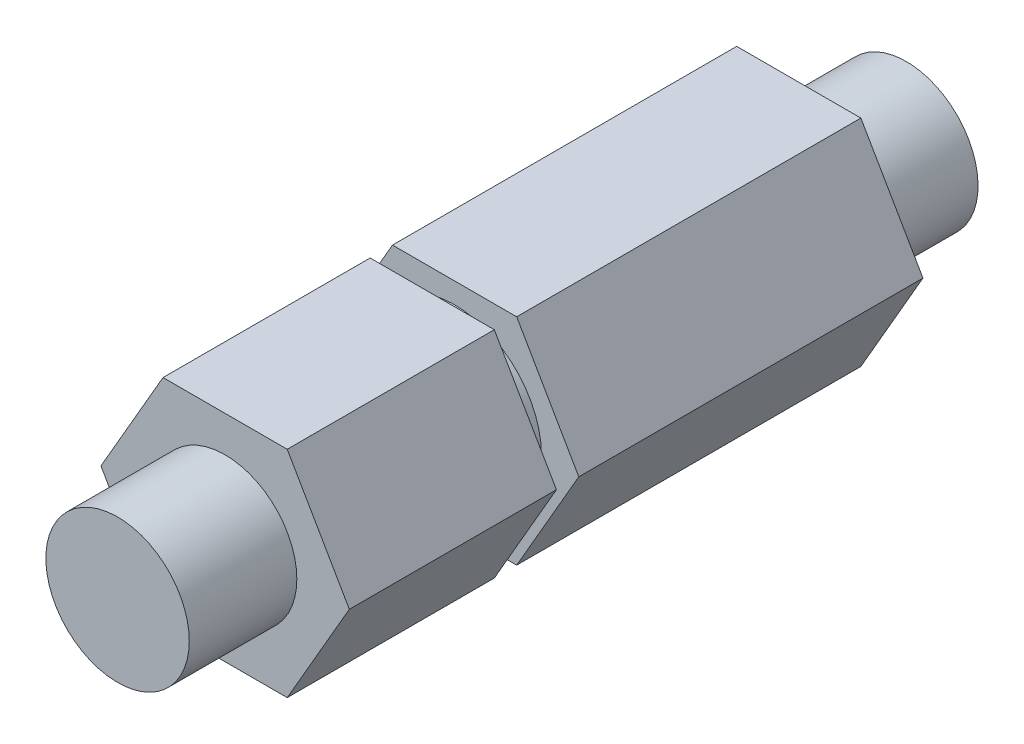
ISO-10303-21;
HEADER;
FILE_DESCRIPTION(('STEP AP214'),'2;1');
FILE_NAME('part.step','',(''),(''),'','','');
FILE_SCHEMA(('AUTOMOTIVE_DESIGN { 1 0 10303 214 1 1 1 1 }'));
ENDSEC;
DATA;
#1=APPLICATION_CONTEXT('core data for automotive mechanical design processes');
#2=APPLICATION_PROTOCOL_DEFINITION('international standard','automotive_design',2000,#1);
#3=PRODUCT_CONTEXT('',#1,'mechanical');
#4=PRODUCT('Part','Part','',(#3));
#5=PRODUCT_RELATED_PRODUCT_CATEGORY('part','',(#4));
#6=PRODUCT_DEFINITION_FORMATION('','',#4);
#7=PRODUCT_DEFINITION_CONTEXT('part definition',#1,'design');
#8=PRODUCT_DEFINITION('design','',#6,#7);
#9=PRODUCT_DEFINITION_SHAPE('','',#8);
#10=(LENGTH_UNIT() NAMED_UNIT(*) SI_UNIT(.MILLI.,.METRE.));
#11=(NAMED_UNIT(*) PLANE_ANGLE_UNIT() SI_UNIT($,.RADIAN.));
#12=(NAMED_UNIT(*) SI_UNIT($,.STERADIAN.) SOLID_ANGLE_UNIT());
#13=UNCERTAINTY_MEASURE_WITH_UNIT(LENGTH_MEASURE(1.E-05),#10,'distance_accuracy_value','');
#14=(GEOMETRIC_REPRESENTATION_CONTEXT(3) GLOBAL_UNCERTAINTY_ASSIGNED_CONTEXT((#13)) GLOBAL_UNIT_ASSIGNED_CONTEXT((#10,
#11,#12)) REPRESENTATION_CONTEXT('',''));
#15=CARTESIAN_POINT('',(0.,0.,0.));
#16=DIRECTION('',(0.,0.,1.));
#17=DIRECTION('',(1.,0.,0.));
#18=AXIS2_PLACEMENT_3D('',#15,#16,#17);
#19=CARTESIAN_POINT('',(0.,0.,2.54));
#20=DIRECTION('',(0.,0.,1.));
#21=DIRECTION('',(1.,0.,0.));
#22=AXIS2_PLACEMENT_3D('',#19,#20,#21);
#23=CYLINDRICAL_SURFACE('',#22,3.8481);
#24=CARTESIAN_POINT('',(0.,0.,3.5306));
#25=DIRECTION('',(0.,0.,-1.));
#26=DIRECTION('',(0.,-1.,0.));
#27=AXIS2_PLACEMENT_3D('',#24,#25,#26);
#28=CIRCLE('',#27,3.8481);
#29=CARTESIAN_POINT('',(0.,-3.8481,3.5306));
#30=VERTEX_POINT('',#29);
#31=EDGE_CURVE('E9',#30,#30,#28,.T.);
#32=ORIENTED_EDGE('',*,*,#31,.T.);
#33=EDGE_LOOP('',(#32));
#34=FACE_BOUND('',#33,.T.);
#35=CARTESIAN_POINT('',(0.,0.,2.54));
#36=DIRECTION('',(0.,0.,1.));
#37=DIRECTION('',(1.,0.,0.));
#38=AXIS2_PLACEMENT_3D('',#35,#36,#37);
#39=CIRCLE('',#38,3.8481);
#40=CARTESIAN_POINT('',(3.8481,0.,2.54));
#41=VERTEX_POINT('',#40);
#42=EDGE_CURVE('E25',#41,#41,#39,.T.);
#43=ORIENTED_EDGE('',*,*,#42,.T.);
#44=EDGE_LOOP('',(#43));
#45=FACE_BOUND('',#44,.T.);
#46=ADVANCED_FACE('F15',(#34,#45),#23,.T.);
#47=CARTESIAN_POINT('',(0.,0.,2.54));
#48=DIRECTION('',(0.,0.,1.));
#49=DIRECTION('',(1.,0.,0.));
#50=AXIS2_PLACEMENT_3D('',#47,#48,#49);
#51=PLANE('',#50);
#52=ORIENTED_EDGE('',*,*,#42,.F.);
#53=EDGE_LOOP('',(#52));
#54=FACE_BOUND('',#53,.T.);
#55=DIRECTION('',(0.5,-0.866025403784439,0.));
#56=VECTOR('',#55,1.);
#57=CARTESIAN_POINT('',(3.43703832126949,3.571875,2.54));
#58=LINE('',#57,#56);
#59=CARTESIAN_POINT('',(2.74963065701559,4.7625,2.54));
#60=VERTEX_POINT('',#59);
#61=CARTESIAN_POINT('',(5.49926131403119,0.,2.54));
#62=VERTEX_POINT('',#61);
#63=EDGE_CURVE('E34',#60,#62,#58,.T.);
#64=ORIENTED_EDGE('',*,*,#63,.F.);
#65=DIRECTION('',(1.,0.,0.));
#66=VECTOR('',#65,1.);
#67=CARTESIAN_POINT('',(-1.3748153285078,4.7625,2.54));
#68=LINE('',#67,#66);
#69=CARTESIAN_POINT('',(-2.74963065701559,4.7625,2.54));
#70=VERTEX_POINT('',#69);
#71=EDGE_CURVE('E157',#70,#60,#68,.T.);
#72=ORIENTED_EDGE('',*,*,#71,.F.);
#73=DIRECTION('',(0.5,0.866025403784439,0.));
#74=VECTOR('',#73,1.);
#75=CARTESIAN_POINT('',(-4.81185364977729,1.190625,2.54));
#76=LINE('',#75,#74);
#77=CARTESIAN_POINT('',(-5.49926131403119,0.,2.54));
#78=VERTEX_POINT('',#77);
#79=EDGE_CURVE('E172',#78,#70,#76,.T.);
#80=ORIENTED_EDGE('',*,*,#79,.F.);
#81=DIRECTION('',(-0.5,0.866025403784439,0.));
#82=VECTOR('',#81,1.);
#83=CARTESIAN_POINT('',(-3.43703832126949,-3.571875,2.54));
#84=LINE('',#83,#82);
#85=CARTESIAN_POINT('',(-2.74963065701559,-4.7625,2.54));
#86=VERTEX_POINT('',#85);
#87=EDGE_CURVE('E202',#86,#78,#84,.T.);
#88=ORIENTED_EDGE('',*,*,#87,.F.);
#89=DIRECTION('',(-1.,0.,0.));
#90=VECTOR('',#89,1.);
#91=CARTESIAN_POINT('',(1.37481532850779,-4.7625,2.54));
#92=LINE('',#91,#90);
#93=CARTESIAN_POINT('',(2.74963065701559,-4.7625,2.54));
#94=VERTEX_POINT('',#93);
#95=EDGE_CURVE('E195',#94,#86,#92,.T.);
#96=ORIENTED_EDGE('',*,*,#95,.F.);
#97=DIRECTION('',(-0.500000000000001,-0.866025403784438,0.));
#98=VECTOR('',#97,1.);
#99=CARTESIAN_POINT('',(4.81185364977729,-1.190625,2.54));
#100=LINE('',#99,#98);
#101=EDGE_CURVE('E160',#62,#94,#100,.T.);
#102=ORIENTED_EDGE('',*,*,#101,.F.);
#103=EDGE_LOOP('',(#64,#72,#80,#88,#96,#102));
#104=FACE_BOUND('',#103,.T.);
#105=ADVANCED_FACE('F222',(#54,#104),#51,.T.);
#106=CARTESIAN_POINT('',(0.,0.,3.5306));
#107=DIRECTION('',(0.,0.,1.));
#108=DIRECTION('',(0.,-1.,0.));
#109=AXIS2_PLACEMENT_3D('',#106,#107,#108);
#110=PLANE('',#109);
#111=ORIENTED_EDGE('',*,*,#31,.F.);
#112=EDGE_LOOP('',(#111));
#113=FACE_BOUND('',#112,.T.);
#114=DIRECTION('',(0.500000000000001,0.866025403784438,0.));
#115=VECTOR('',#114,1.);
#116=CARTESIAN_POINT('',(4.81185364977729,-1.190625,3.5306));
#117=LINE('',#116,#115);
#118=CARTESIAN_POINT('',(2.74963065701559,-4.7625,3.5306));
#119=VERTEX_POINT('',#118);
#120=CARTESIAN_POINT('',(5.49926131403119,0.,3.5306));
#121=VERTEX_POINT('',#120);
#122=EDGE_CURVE('E176',#119,#121,#117,.T.);
#123=ORIENTED_EDGE('',*,*,#122,.F.);
#124=DIRECTION('',(1.,0.,0.));
#125=VECTOR('',#124,1.);
#126=CARTESIAN_POINT('',(1.37481532850779,-4.7625,3.5306));
#127=LINE('',#126,#125);
#128=CARTESIAN_POINT('',(-2.74963065701559,-4.7625,3.5306));
#129=VERTEX_POINT('',#128);
#130=EDGE_CURVE('E186',#129,#119,#127,.T.);
#131=ORIENTED_EDGE('',*,*,#130,.F.);
#132=DIRECTION('',(0.5,-0.866025403784439,0.));
#133=VECTOR('',#132,1.);
#134=CARTESIAN_POINT('',(-3.43703832126949,-3.571875,3.5306));
#135=LINE('',#134,#133);
#136=CARTESIAN_POINT('',(-5.49926131403119,0.,3.5306));
#137=VERTEX_POINT('',#136);
#138=EDGE_CURVE('E116',#137,#129,#135,.T.);
#139=ORIENTED_EDGE('',*,*,#138,.F.);
#140=DIRECTION('',(-0.5,-0.866025403784439,0.));
#141=VECTOR('',#140,1.);
#142=CARTESIAN_POINT('',(-4.81185364977729,1.190625,3.5306));
#143=LINE('',#142,#141);
#144=CARTESIAN_POINT('',(-2.74963065701559,4.7625,3.5306));
#145=VERTEX_POINT('',#144);
#146=EDGE_CURVE('E122',#145,#137,#143,.T.);
#147=ORIENTED_EDGE('',*,*,#146,.F.);
#148=DIRECTION('',(-1.,0.,0.));
#149=VECTOR('',#148,1.);
#150=CARTESIAN_POINT('',(-1.3748153285078,4.7625,3.5306));
#151=LINE('',#150,#149);
#152=CARTESIAN_POINT('',(2.74963065701559,4.7625,3.5306));
#153=VERTEX_POINT('',#152);
#154=EDGE_CURVE('E113',#153,#145,#151,.T.);
#155=ORIENTED_EDGE('',*,*,#154,.F.);
#156=DIRECTION('',(-0.5,0.866025403784439,0.));
#157=VECTOR('',#156,1.);
#158=CARTESIAN_POINT('',(3.43703832126949,3.571875,3.5306));
#159=LINE('',#158,#157);
#160=EDGE_CURVE('E165',#121,#153,#159,.T.);
#161=ORIENTED_EDGE('',*,*,#160,.F.);
#162=EDGE_LOOP('',(#123,#131,#139,#147,#155,#161));
#163=FACE_BOUND('',#162,.T.);
#164=ADVANCED_FACE('F224',(#113,#163),#110,.F.);
#165=CARTESIAN_POINT('',(-2.74963065701559,-4.7625,0.));
#166=DIRECTION('',(-0.866025403784439,-0.5,0.));
#167=DIRECTION('',(0.5,-0.866025403784439,0.));
#168=AXIS2_PLACEMENT_3D('',#165,#166,#167);
#169=PLANE('',#168);
#170=ORIENTED_EDGE('',*,*,#87,.T.);
#171=DIRECTION('',(0.,0.,-1.));
#172=VECTOR('',#171,1.);
#173=CARTESIAN_POINT('',(-5.49926131403119,0.,0.));
#174=LINE('',#173,#172);
#175=CARTESIAN_POINT('',(-5.49926131403119,0.,-12.7));
#176=VERTEX_POINT('',#175);
#177=EDGE_CURVE('E199',#78,#176,#174,.T.);
#178=ORIENTED_EDGE('',*,*,#177,.T.);
#179=DIRECTION('',(0.5,-0.866025403784439,0.));
#180=VECTOR('',#179,1.);
#181=CARTESIAN_POINT('',(-3.43703832126949,-3.571875,-12.7));
#182=LINE('',#181,#180);
#183=CARTESIAN_POINT('',(-2.74963065701559,-4.7625,-12.7));
#184=VERTEX_POINT('',#183);
#185=EDGE_CURVE('E196',#176,#184,#182,.T.);
#186=ORIENTED_EDGE('',*,*,#185,.T.);
#187=DIRECTION('',(0.,0.,-1.));
#188=VECTOR('',#187,1.);
#189=CARTESIAN_POINT('',(-2.74963065701559,-4.7625,0.));
#190=LINE('',#189,#188);
#191=EDGE_CURVE('E193',#86,#184,#190,.T.);
#192=ORIENTED_EDGE('',*,*,#191,.F.);
#193=EDGE_LOOP('',(#170,#178,#186,#192));
#194=FACE_BOUND('',#193,.T.);
#195=ADVANCED_FACE('F231',(#194),#169,.T.);
#196=CARTESIAN_POINT('',(2.74963065701559,-4.7625,0.));
#197=DIRECTION('',(0.,-1.,0.));
#198=DIRECTION('',(1.,0.,0.));
#199=AXIS2_PLACEMENT_3D('',#196,#197,#198);
#200=PLANE('',#199);
#201=ORIENTED_EDGE('',*,*,#95,.T.);
#202=ORIENTED_EDGE('',*,*,#191,.T.);
#203=DIRECTION('',(1.,0.,0.));
#204=VECTOR('',#203,1.);
#205=CARTESIAN_POINT('',(1.37481532850779,-4.7625,-12.7));
#206=LINE('',#205,#204);
#207=CARTESIAN_POINT('',(2.74963065701559,-4.7625,-12.7));
#208=VERTEX_POINT('',#207);
#209=EDGE_CURVE('E190',#184,#208,#206,.T.);
#210=ORIENTED_EDGE('',*,*,#209,.T.);
#211=DIRECTION('',(0.,0.,-1.));
#212=VECTOR('',#211,1.);
#213=CARTESIAN_POINT('',(2.74963065701559,-4.7625,0.));
#214=LINE('',#213,#212);
#215=EDGE_CURVE('E144',#94,#208,#214,.T.);
#216=ORIENTED_EDGE('',*,*,#215,.F.);
#217=EDGE_LOOP('',(#201,#202,#210,#216));
#218=FACE_BOUND('',#217,.T.);
#219=ADVANCED_FACE('F239',(#218),#200,.T.);
#220=CARTESIAN_POINT('',(2.74963065701559,-4.7625,0.));
#221=DIRECTION('',(0.,-1.,0.));
#222=DIRECTION('',(1.,0.,0.));
#223=AXIS2_PLACEMENT_3D('',#220,#221,#222);
#224=PLANE('',#223);
#225=ORIENTED_EDGE('',*,*,#130,.T.);
#226=DIRECTION('',(0.,0.,-1.));
#227=VECTOR('',#226,1.);
#228=CARTESIAN_POINT('',(2.74963065701559,-4.7625,0.));
#229=LINE('',#228,#227);
#230=CARTESIAN_POINT('',(2.74963065701559,-4.7625,12.7));
#231=VERTEX_POINT('',#230);
#232=EDGE_CURVE('E177',#231,#119,#229,.T.);
#233=ORIENTED_EDGE('',*,*,#232,.F.);
#234=DIRECTION('',(-1.,0.,0.));
#235=VECTOR('',#234,1.);
#236=CARTESIAN_POINT('',(1.37481532850779,-4.7625,12.7));
#237=LINE('',#236,#235);
#238=CARTESIAN_POINT('',(-2.74963065701559,-4.7625,12.7));
#239=VERTEX_POINT('',#238);
#240=EDGE_CURVE('E183',#231,#239,#237,.T.);
#241=ORIENTED_EDGE('',*,*,#240,.T.);
#242=DIRECTION('',(0.,0.,-1.));
#243=VECTOR('',#242,1.);
#244=CARTESIAN_POINT('',(-2.74963065701559,-4.7625,0.));
#245=LINE('',#244,#243);
#246=EDGE_CURVE('E180',#239,#129,#245,.T.);
#247=ORIENTED_EDGE('',*,*,#246,.T.);
#248=EDGE_LOOP('',(#225,#233,#241,#247));
#249=FACE_BOUND('',#248,.T.);
#250=ADVANCED_FACE('F243',(#249),#224,.T.);
#251=CARTESIAN_POINT('',(5.49926131403119,0.,0.));
#252=DIRECTION('',(0.866025403784438,-0.500000000000001,0.));
#253=DIRECTION('',(0.500000000000001,0.866025403784438,0.));
#254=AXIS2_PLACEMENT_3D('',#251,#252,#253);
#255=PLANE('',#254);
#256=ORIENTED_EDGE('',*,*,#122,.T.);
#257=DIRECTION('',(0.,0.,-1.));
#258=VECTOR('',#257,1.);
#259=CARTESIAN_POINT('',(5.49926131403119,0.,0.));
#260=LINE('',#259,#258);
#261=CARTESIAN_POINT('',(5.49926131403119,0.,12.7));
#262=VERTEX_POINT('',#261);
#263=EDGE_CURVE('E163',#262,#121,#260,.T.);
#264=ORIENTED_EDGE('',*,*,#263,.F.);
#265=DIRECTION('',(-0.500000000000001,-0.866025403784438,0.));
#266=VECTOR('',#265,1.);
#267=CARTESIAN_POINT('',(4.81185364977729,-1.190625,12.7));
#268=LINE('',#267,#266);
#269=EDGE_CURVE('E173',#262,#231,#268,.T.);
#270=ORIENTED_EDGE('',*,*,#269,.T.);
#271=ORIENTED_EDGE('',*,*,#232,.T.);
#272=EDGE_LOOP('',(#256,#264,#270,#271));
#273=FACE_BOUND('',#272,.T.);
#274=ADVANCED_FACE('F247',(#273),#255,.T.);
#275=CARTESIAN_POINT('',(-5.49926131403119,0.,0.));
#276=DIRECTION('',(-0.866025403784439,0.5,0.));
#277=DIRECTION('',(-0.5,-0.866025403784439,0.));
#278=AXIS2_PLACEMENT_3D('',#275,#276,#277);
#279=PLANE('',#278);
#280=ORIENTED_EDGE('',*,*,#79,.T.);
#281=DIRECTION('',(0.,0.,-1.));
#282=VECTOR('',#281,1.);
#283=CARTESIAN_POINT('',(-2.74963065701559,4.7625,0.));
#284=LINE('',#283,#282);
#285=CARTESIAN_POINT('',(-2.74963065701559,4.7625,-12.7));
#286=VERTEX_POINT('',#285);
#287=EDGE_CURVE('E169',#70,#286,#284,.T.);
#288=ORIENTED_EDGE('',*,*,#287,.T.);
#289=DIRECTION('',(-0.5,-0.866025403784439,0.));
#290=VECTOR('',#289,1.);
#291=CARTESIAN_POINT('',(-4.81185364977729,1.190625,-12.7));
#292=LINE('',#291,#290);
#293=EDGE_CURVE('E166',#286,#176,#292,.T.);
#294=ORIENTED_EDGE('',*,*,#293,.T.);
#295=ORIENTED_EDGE('',*,*,#177,.F.);
#296=EDGE_LOOP('',(#280,#288,#294,#295));
#297=FACE_BOUND('',#296,.T.);
#298=ADVANCED_FACE('F251',(#297),#279,.T.);
#299=CARTESIAN_POINT('',(2.74963065701559,4.7625,0.));
#300=DIRECTION('',(0.866025403784439,0.5,0.));
#301=DIRECTION('',(-0.5,0.866025403784439,0.));
#302=AXIS2_PLACEMENT_3D('',#299,#300,#301);
#303=PLANE('',#302);
#304=ORIENTED_EDGE('',*,*,#160,.T.);
#305=DIRECTION('',(0.,0.,1.));
#306=VECTOR('',#305,1.);
#307=CARTESIAN_POINT('',(2.74963065701559,4.7625,0.));
#308=LINE('',#307,#306);
#309=CARTESIAN_POINT('',(2.74963065701559,4.7625,12.7));
#310=VERTEX_POINT('',#309);
#311=EDGE_CURVE('E162',#153,#310,#308,.T.);
#312=ORIENTED_EDGE('',*,*,#311,.T.);
#313=DIRECTION('',(0.5,-0.866025403784439,0.));
#314=VECTOR('',#313,1.);
#315=CARTESIAN_POINT('',(3.43703832126949,3.571875,12.7));
#316=LINE('',#315,#314);
#317=EDGE_CURVE('E127',#310,#262,#316,.T.);
#318=ORIENTED_EDGE('',*,*,#317,.T.);
#319=ORIENTED_EDGE('',*,*,#263,.T.);
#320=EDGE_LOOP('',(#304,#312,#318,#319));
#321=FACE_BOUND('',#320,.T.);
#322=ADVANCED_FACE('F255',(#321),#303,.T.);
#323=CARTESIAN_POINT('',(-2.74963065701559,4.7625,0.));
#324=DIRECTION('',(0.,1.,0.));
#325=DIRECTION('',(0.,0.,1.));
#326=AXIS2_PLACEMENT_3D('',#323,#324,#325);
#327=PLANE('',#326);
#328=ORIENTED_EDGE('',*,*,#71,.T.);
#329=DIRECTION('',(0.,0.,1.));
#330=VECTOR('',#329,1.);
#331=CARTESIAN_POINT('',(2.74963065701559,4.7625,0.));
#332=LINE('',#331,#330);
#333=CARTESIAN_POINT('',(2.74963065701559,4.7625,-12.7));
#334=VERTEX_POINT('',#333);
#335=EDGE_CURVE('E148',#334,#60,#332,.T.);
#336=ORIENTED_EDGE('',*,*,#335,.F.);
#337=DIRECTION('',(-1.,0.,0.));
#338=VECTOR('',#337,1.);
#339=CARTESIAN_POINT('',(-1.3748153285078,4.7625,-12.7));
#340=LINE('',#339,#338);
#341=EDGE_CURVE('E154',#334,#286,#340,.T.);
#342=ORIENTED_EDGE('',*,*,#341,.T.);
#343=ORIENTED_EDGE('',*,*,#287,.F.);
#344=EDGE_LOOP('',(#328,#336,#342,#343));
#345=FACE_BOUND('',#344,.T.);
#346=ADVANCED_FACE('F259',(#345),#327,.T.);
#347=CARTESIAN_POINT('',(0.,0.,-17.4625));
#348=DIRECTION('',(0.,0.,-1.));
#349=DIRECTION('',(0.,-1.,0.));
#350=AXIS2_PLACEMENT_3D('',#347,#348,#349);
#351=CYLINDRICAL_SURFACE('',#350,3.175);
#352=CARTESIAN_POINT('',(0.,0.,-12.7));
#353=DIRECTION('',(0.,0.,1.));
#354=DIRECTION('',(1.,0.,0.));
#355=AXIS2_PLACEMENT_3D('',#352,#353,#354);
#356=CIRCLE('',#355,3.175);
#357=CARTESIAN_POINT('',(3.175,0.,-12.7));
#358=VERTEX_POINT('',#357);
#359=EDGE_CURVE('E151',#358,#358,#356,.T.);
#360=ORIENTED_EDGE('',*,*,#359,.F.);
#361=EDGE_LOOP('',(#360));
#362=FACE_BOUND('',#361,.T.);
#363=CARTESIAN_POINT('',(0.,0.,-17.4625));
#364=DIRECTION('',(0.,0.,-1.));
#365=DIRECTION('',(0.,-1.,0.));
#366=AXIS2_PLACEMENT_3D('',#363,#364,#365);
#367=CIRCLE('',#366,3.175);
#368=CARTESIAN_POINT('',(0.,-3.175,-17.4625));
#369=VERTEX_POINT('',#368);
#370=EDGE_CURVE('E136',#369,#369,#367,.T.);
#371=ORIENTED_EDGE('',*,*,#370,.F.);
#372=EDGE_LOOP('',(#371));
#373=FACE_BOUND('',#372,.T.);
#374=ADVANCED_FACE('F263',(#362,#373),#351,.T.);
#375=CARTESIAN_POINT('',(0.,0.,-12.7));
#376=DIRECTION('',(0.,0.,-1.));
#377=DIRECTION('',(0.,1.,0.));
#378=AXIS2_PLACEMENT_3D('',#375,#376,#377);
#379=PLANE('',#378);
#380=ORIENTED_EDGE('',*,*,#359,.T.);
#381=EDGE_LOOP('',(#380));
#382=FACE_BOUND('',#381,.T.);
#383=DIRECTION('',(-0.5,0.866025403784439,0.));
#384=VECTOR('',#383,1.);
#385=CARTESIAN_POINT('',(3.43703832126949,3.571875,-12.7));
#386=LINE('',#385,#384);
#387=CARTESIAN_POINT('',(5.49926131403119,0.,-12.7));
#388=VERTEX_POINT('',#387);
#389=EDGE_CURVE('E145',#388,#334,#386,.T.);
#390=ORIENTED_EDGE('',*,*,#389,.F.);
#391=DIRECTION('',(0.500000000000001,0.866025403784438,0.));
#392=VECTOR('',#391,1.);
#393=CARTESIAN_POINT('',(4.81185364977729,-1.190625,-12.7));
#394=LINE('',#393,#392);
#395=EDGE_CURVE('E142',#208,#388,#394,.T.);
#396=ORIENTED_EDGE('',*,*,#395,.F.);
#397=ORIENTED_EDGE('',*,*,#209,.F.);
#398=ORIENTED_EDGE('',*,*,#185,.F.);
#399=ORIENTED_EDGE('',*,*,#293,.F.);
#400=ORIENTED_EDGE('',*,*,#341,.F.);
#401=EDGE_LOOP('',(#390,#396,#397,#398,#399,#400));
#402=FACE_BOUND('',#401,.T.);
#403=ADVANCED_FACE('F267',(#382,#402),#379,.T.);
#404=CARTESIAN_POINT('',(-5.49926131403119,0.,0.));
#405=DIRECTION('',(-0.866025403784439,0.5,0.));
#406=DIRECTION('',(-0.5,-0.866025403784439,0.));
#407=AXIS2_PLACEMENT_3D('',#404,#405,#406);
#408=PLANE('',#407);
#409=ORIENTED_EDGE('',*,*,#146,.T.);
#410=DIRECTION('',(0.,0.,-1.));
#411=VECTOR('',#410,1.);
#412=CARTESIAN_POINT('',(-5.49926131403119,0.,0.));
#413=LINE('',#412,#411);
#414=CARTESIAN_POINT('',(-5.49926131403119,0.,12.7));
#415=VERTEX_POINT('',#414);
#416=EDGE_CURVE('E102',#415,#137,#413,.T.);
#417=ORIENTED_EDGE('',*,*,#416,.F.);
#418=DIRECTION('',(0.5,0.866025403784439,0.));
#419=VECTOR('',#418,1.);
#420=CARTESIAN_POINT('',(-4.81185364977729,1.190625,12.7));
#421=LINE('',#420,#419);
#422=CARTESIAN_POINT('',(-2.74963065701559,4.7625,12.7));
#423=VERTEX_POINT('',#422);
#424=EDGE_CURVE('E115',#415,#423,#421,.T.);
#425=ORIENTED_EDGE('',*,*,#424,.T.);
#426=DIRECTION('',(0.,0.,-1.));
#427=VECTOR('',#426,1.);
#428=CARTESIAN_POINT('',(-2.74963065701559,4.7625,0.));
#429=LINE('',#428,#427);
#430=EDGE_CURVE('E108',#423,#145,#429,.T.);
#431=ORIENTED_EDGE('',*,*,#430,.T.);
#432=EDGE_LOOP('',(#409,#417,#425,#431));
#433=FACE_BOUND('',#432,.T.);
#434=ADVANCED_FACE('F118',(#433),#408,.T.);
#435=CARTESIAN_POINT('',(-2.74963065701559,-4.7625,0.));
#436=DIRECTION('',(-0.866025403784439,-0.5,0.));
#437=DIRECTION('',(0.5,-0.866025403784439,0.));
#438=AXIS2_PLACEMENT_3D('',#435,#436,#437);
#439=PLANE('',#438);
#440=ORIENTED_EDGE('',*,*,#138,.T.);
#441=ORIENTED_EDGE('',*,*,#246,.F.);
#442=DIRECTION('',(-0.5,0.866025403784439,0.));
#443=VECTOR('',#442,1.);
#444=CARTESIAN_POINT('',(-3.43703832126949,-3.571875,12.7));
#445=LINE('',#444,#443);
#446=EDGE_CURVE('E139',#239,#415,#445,.T.);
#447=ORIENTED_EDGE('',*,*,#446,.T.);
#448=ORIENTED_EDGE('',*,*,#416,.T.);
#449=EDGE_LOOP('',(#440,#441,#447,#448));
#450=FACE_BOUND('',#449,.T.);
#451=ADVANCED_FACE('F271',(#450),#439,.T.);
#452=CARTESIAN_POINT('',(0.,0.,17.4625));
#453=DIRECTION('',(0.,0.,-1.));
#454=DIRECTION('',(0.,-1.,0.));
#455=AXIS2_PLACEMENT_3D('',#452,#453,#454);
#456=CYLINDRICAL_SURFACE('',#455,3.175);
#457=CARTESIAN_POINT('',(0.,0.,12.7));
#458=DIRECTION('',(0.,0.,1.));
#459=DIRECTION('',(1.,0.,0.));
#460=AXIS2_PLACEMENT_3D('',#457,#458,#459);
#461=CIRCLE('',#460,3.175);
#462=CARTESIAN_POINT('',(3.175,0.,12.7));
#463=VERTEX_POINT('',#462);
#464=EDGE_CURVE('E129',#463,#463,#461,.T.);
#465=ORIENTED_EDGE('',*,*,#464,.T.);
#466=EDGE_LOOP('',(#465));
#467=FACE_BOUND('',#466,.T.);
#468=CARTESIAN_POINT('',(0.,0.,17.4625));
#469=DIRECTION('',(0.,0.,1.));
#470=DIRECTION('',(1.,0.,0.));
#471=AXIS2_PLACEMENT_3D('',#468,#469,#470);
#472=CIRCLE('',#471,3.175);
#473=CARTESIAN_POINT('',(3.175,0.,17.4625));
#474=VERTEX_POINT('',#473);
#475=EDGE_CURVE('E133',#474,#474,#472,.T.);
#476=ORIENTED_EDGE('',*,*,#475,.F.);
#477=EDGE_LOOP('',(#476));
#478=FACE_BOUND('',#477,.T.);
#479=ADVANCED_FACE('F17',(#467,#478),#456,.T.);
#480=CARTESIAN_POINT('',(0.,0.,12.7));
#481=DIRECTION('',(0.,0.,1.));
#482=DIRECTION('',(0.,-1.,0.));
#483=AXIS2_PLACEMENT_3D('',#480,#481,#482);
#484=PLANE('',#483);
#485=ORIENTED_EDGE('',*,*,#464,.F.);
#486=EDGE_LOOP('',(#485));
#487=FACE_BOUND('',#486,.T.);
#488=ORIENTED_EDGE('',*,*,#317,.F.);
#489=DIRECTION('',(1.,0.,0.));
#490=VECTOR('',#489,1.);
#491=CARTESIAN_POINT('',(-1.3748153285078,4.7625,12.7));
#492=LINE('',#491,#490);
#493=EDGE_CURVE('E112',#423,#310,#492,.T.);
#494=ORIENTED_EDGE('',*,*,#493,.F.);
#495=ORIENTED_EDGE('',*,*,#424,.F.);
#496=ORIENTED_EDGE('',*,*,#446,.F.);
#497=ORIENTED_EDGE('',*,*,#240,.F.);
#498=ORIENTED_EDGE('',*,*,#269,.F.);
#499=EDGE_LOOP('',(#488,#494,#495,#496,#497,#498));
#500=FACE_BOUND('',#499,.T.);
#501=ADVANCED_FACE('F124',(#487,#500),#484,.T.);
#502=CARTESIAN_POINT('',(-2.74963065701559,4.7625,0.));
#503=DIRECTION('',(0.,1.,0.));
#504=DIRECTION('',(0.,0.,1.));
#505=AXIS2_PLACEMENT_3D('',#502,#503,#504);
#506=PLANE('',#505);
#507=ORIENTED_EDGE('',*,*,#154,.T.);
#508=ORIENTED_EDGE('',*,*,#430,.F.);
#509=ORIENTED_EDGE('',*,*,#493,.T.);
#510=ORIENTED_EDGE('',*,*,#311,.F.);
#511=EDGE_LOOP('',(#507,#508,#509,#510));
#512=FACE_BOUND('',#511,.T.);
#513=ADVANCED_FACE('F109',(#512),#506,.T.);
#514=CARTESIAN_POINT('',(2.74963065701559,4.7625,0.));
#515=DIRECTION('',(0.866025403784439,0.5,0.));
#516=DIRECTION('',(-0.5,0.866025403784439,0.));
#517=AXIS2_PLACEMENT_3D('',#514,#515,#516);
#518=PLANE('',#517);
#519=ORIENTED_EDGE('',*,*,#63,.T.);
#520=DIRECTION('',(0.,0.,-1.));
#521=VECTOR('',#520,1.);
#522=CARTESIAN_POINT('',(5.49926131403119,0.,0.));
#523=LINE('',#522,#521);
#524=EDGE_CURVE('E19',#62,#388,#523,.T.);
#525=ORIENTED_EDGE('',*,*,#524,.T.);
#526=ORIENTED_EDGE('',*,*,#389,.T.);
#527=ORIENTED_EDGE('',*,*,#335,.T.);
#528=EDGE_LOOP('',(#519,#525,#526,#527));
#529=FACE_BOUND('',#528,.T.);
#530=ADVANCED_FACE('F280',(#529),#518,.T.);
#531=CARTESIAN_POINT('',(5.49926131403119,0.,0.));
#532=DIRECTION('',(0.866025403784438,-0.500000000000001,0.));
#533=DIRECTION('',(0.500000000000001,0.866025403784438,0.));
#534=AXIS2_PLACEMENT_3D('',#531,#532,#533);
#535=PLANE('',#534);
#536=ORIENTED_EDGE('',*,*,#101,.T.);
#537=ORIENTED_EDGE('',*,*,#215,.T.);
#538=ORIENTED_EDGE('',*,*,#395,.T.);
#539=ORIENTED_EDGE('',*,*,#524,.F.);
#540=EDGE_LOOP('',(#536,#537,#538,#539));
#541=FACE_BOUND('',#540,.T.);
#542=ADVANCED_FACE('F283',(#541),#535,.T.);
#543=CARTESIAN_POINT('',(0.,0.,-17.4625));
#544=DIRECTION('',(0.,0.,1.));
#545=DIRECTION('',(1.,0.,0.));
#546=AXIS2_PLACEMENT_3D('',#543,#544,#545);
#547=PLANE('',#546);
#548=ORIENTED_EDGE('',*,*,#370,.T.);
#549=EDGE_LOOP('',(#548));
#550=FACE_BOUND('',#549,.T.);
#551=ADVANCED_FACE('F287',(#550),#547,.F.);
#552=CARTESIAN_POINT('',(0.,0.,17.4625));
#553=DIRECTION('',(0.,0.,1.));
#554=DIRECTION('',(1.,0.,0.));
#555=AXIS2_PLACEMENT_3D('',#552,#553,#554);
#556=PLANE('',#555);
#557=ORIENTED_EDGE('',*,*,#475,.T.);
#558=EDGE_LOOP('',(#557));
#559=FACE_BOUND('',#558,.T.);
#560=ADVANCED_FACE('F291',(#559),#556,.T.);
#561=CLOSED_SHELL('',(#46,#105,#164,#195,#219,#250,#274,#298,#322,#346,#374,#403,#434,#451,#479,
#501,#513,#530,#542,#551,#560));
#562=MANIFOLD_SOLID_BREP('B1',#561);
#563=ADVANCED_BREP_SHAPE_REPRESENTATION('',(#18,#562),#14);
#564=SHAPE_DEFINITION_REPRESENTATION(#9,#563);
ENDSEC;
END-ISO-10303-21;
